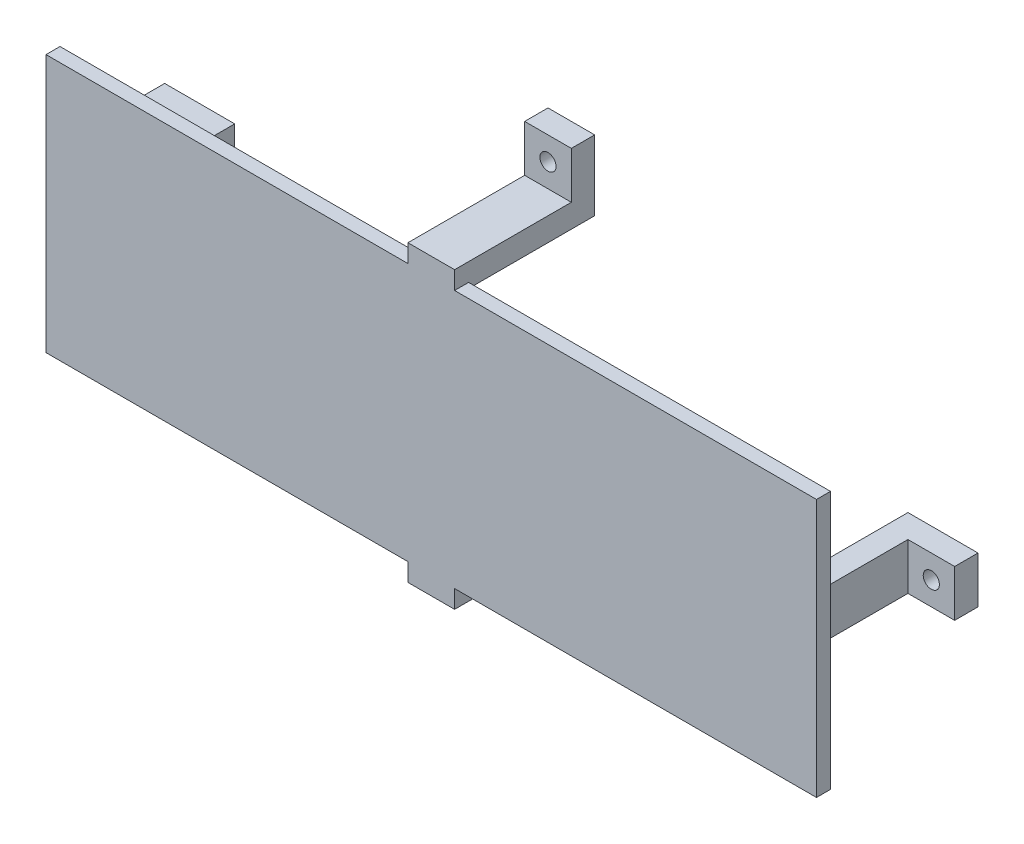
ISO-10303-21;
HEADER;
FILE_DESCRIPTION(('STEP AP214'),'2;1');
FILE_NAME('part.step','',(''),(''),'','','');
FILE_SCHEMA(('AUTOMOTIVE_DESIGN { 1 0 10303 214 1 1 1 1 }'));
ENDSEC;
DATA;
#1=APPLICATION_CONTEXT('core data for automotive mechanical design processes');
#2=APPLICATION_PROTOCOL_DEFINITION('international standard','automotive_design',2000,#1);
#3=PRODUCT_CONTEXT('',#1,'mechanical');
#4=PRODUCT('Part','Part','',(#3));
#5=PRODUCT_RELATED_PRODUCT_CATEGORY('part','',(#4));
#6=PRODUCT_DEFINITION_FORMATION('','',#4);
#7=PRODUCT_DEFINITION_CONTEXT('part definition',#1,'design');
#8=PRODUCT_DEFINITION('design','',#6,#7);
#9=PRODUCT_DEFINITION_SHAPE('','',#8);
#10=(LENGTH_UNIT() NAMED_UNIT(*) SI_UNIT(.MILLI.,.METRE.));
#11=(NAMED_UNIT(*) PLANE_ANGLE_UNIT() SI_UNIT($,.RADIAN.));
#12=(NAMED_UNIT(*) SI_UNIT($,.STERADIAN.) SOLID_ANGLE_UNIT());
#13=UNCERTAINTY_MEASURE_WITH_UNIT(LENGTH_MEASURE(1.E-05),#10,'distance_accuracy_value','');
#14=(GEOMETRIC_REPRESENTATION_CONTEXT(3) GLOBAL_UNCERTAINTY_ASSIGNED_CONTEXT((#13)) GLOBAL_UNIT_ASSIGNED_CONTEXT((#10,
#11,#12)) REPRESENTATION_CONTEXT('',''));
#15=CARTESIAN_POINT('',(0.,0.,0.));
#16=DIRECTION('',(0.,0.,1.));
#17=DIRECTION('',(1.,0.,0.));
#18=AXIS2_PLACEMENT_3D('',#15,#16,#17);
#19=CARTESIAN_POINT('',(-5.,-31.5,27.));
#20=DIRECTION('',(0.,1.,0.));
#21=DIRECTION('',(0.,0.,1.));
#22=AXIS2_PLACEMENT_3D('',#19,#20,#21);
#23=PLANE('',#22);
#24=DIRECTION('',(-1.,0.,0.));
#25=VECTOR('',#24,1.);
#26=CARTESIAN_POINT('',(16.180339887499,-31.5,5.));
#27=LINE('',#26,#25);
#28=CARTESIAN_POINT('',(5.,-31.5,5.));
#29=VERTEX_POINT('',#28);
#30=CARTESIAN_POINT('',(-5.00000000000001,-31.5,5.));
#31=VERTEX_POINT('',#30);
#32=EDGE_CURVE('E55',#29,#31,#27,.T.);
#33=ORIENTED_EDGE('',*,*,#32,.F.);
#34=DIRECTION('',(0.,0.,-1.));
#35=VECTOR('',#34,1.);
#36=CARTESIAN_POINT('',(5.,-31.5,27.));
#37=LINE('',#36,#35);
#38=CARTESIAN_POINT('',(5.,-31.5,30.));
#39=VERTEX_POINT('',#38);
#40=EDGE_CURVE('E431',#39,#29,#37,.T.);
#41=ORIENTED_EDGE('',*,*,#40,.F.);
#42=DIRECTION('',(1.,0.,0.));
#43=VECTOR('',#42,1.);
#44=CARTESIAN_POINT('',(-5.,-31.5,30.));
#45=LINE('',#44,#43);
#46=CARTESIAN_POINT('',(-5.,-31.5,30.));
#47=VERTEX_POINT('',#46);
#48=EDGE_CURVE('E377',#47,#39,#45,.T.);
#49=ORIENTED_EDGE('',*,*,#48,.F.);
#50=DIRECTION('',(0.,0.,-1.));
#51=VECTOR('',#50,1.);
#52=CARTESIAN_POINT('',(-5.,-31.5,27.));
#53=LINE('',#52,#51);
#54=EDGE_CURVE('E434',#47,#31,#53,.T.);
#55=ORIENTED_EDGE('',*,*,#54,.T.);
#56=EDGE_LOOP('',(#33,#41,#49,#55));
#57=FACE_BOUND('',#56,.T.);
#58=ADVANCED_FACE('F39',(#57),#23,.F.);
#59=CARTESIAN_POINT('',(-82.5,-27.64,30.));
#60=DIRECTION('',(0.,1.,0.));
#61=DIRECTION('',(0.,0.,1.));
#62=AXIS2_PLACEMENT_3D('',#59,#60,#61);
#63=PLANE('',#62);
#64=DIRECTION('',(0.,0.,-1.));
#65=VECTOR('',#64,1.);
#66=CARTESIAN_POINT('',(5.,-27.64,40.7191230984629));
#67=LINE('',#66,#65);
#68=CARTESIAN_POINT('',(5.,-27.64,30.));
#69=VERTEX_POINT('',#68);
#70=CARTESIAN_POINT('',(5.,-27.64,27.));
#71=VERTEX_POINT('',#70);
#72=EDGE_CURVE('E354',#69,#71,#67,.T.);
#73=ORIENTED_EDGE('',*,*,#72,.T.);
#74=DIRECTION('',(1.,0.,0.));
#75=VECTOR('',#74,1.);
#76=CARTESIAN_POINT('',(-82.5,-27.64,27.));
#77=LINE('',#76,#75);
#78=CARTESIAN_POINT('',(82.5,-27.64,27.));
#79=VERTEX_POINT('',#78);
#80=EDGE_CURVE('E533',#71,#79,#77,.T.);
#81=ORIENTED_EDGE('',*,*,#80,.T.);
#82=DIRECTION('',(0.,0.,-1.));
#83=VECTOR('',#82,1.);
#84=CARTESIAN_POINT('',(82.5,-27.64,30.));
#85=LINE('',#84,#83);
#86=CARTESIAN_POINT('',(82.5,-27.64,30.));
#87=VERTEX_POINT('',#86);
#88=EDGE_CURVE('E552',#87,#79,#85,.T.);
#89=ORIENTED_EDGE('',*,*,#88,.F.);
#90=DIRECTION('',(1.,0.,0.));
#91=VECTOR('',#90,1.);
#92=CARTESIAN_POINT('',(-82.5,-27.64,30.));
#93=LINE('',#92,#91);
#94=EDGE_CURVE('E515',#69,#87,#93,.T.);
#95=ORIENTED_EDGE('',*,*,#94,.F.);
#96=EDGE_LOOP('',(#73,#81,#89,#95));
#97=FACE_BOUND('',#96,.T.);
#98=ADVANCED_FACE('F635',(#97),#63,.F.);
#99=DIRECTION('',(0.,0.,-1.));
#100=VECTOR('',#99,1.);
#101=CARTESIAN_POINT('',(-5.,-27.64,40.7191230984629));
#102=LINE('',#101,#100);
#103=CARTESIAN_POINT('',(-5.,-27.64,30.));
#104=VERTEX_POINT('',#103);
#105=CARTESIAN_POINT('',(-5.,-27.64,27.));
#106=VERTEX_POINT('',#105);
#107=EDGE_CURVE('E385',#104,#106,#102,.T.);
#108=ORIENTED_EDGE('',*,*,#107,.F.);
#109=CARTESIAN_POINT('',(-82.5,-27.64,30.));
#110=VERTEX_POINT('',#109);
#111=EDGE_CURVE('E517',#110,#104,#93,.T.);
#112=ORIENTED_EDGE('',*,*,#111,.F.);
#113=DIRECTION('',(0.,0.,-1.));
#114=VECTOR('',#113,1.);
#115=CARTESIAN_POINT('',(-82.5,-27.64,30.));
#116=LINE('',#115,#114);
#117=CARTESIAN_POINT('',(-82.5,-27.64,27.));
#118=VERTEX_POINT('',#117);
#119=EDGE_CURVE('E556',#110,#118,#116,.T.);
#120=ORIENTED_EDGE('',*,*,#119,.T.);
#121=EDGE_CURVE('E534',#118,#106,#77,.T.);
#122=ORIENTED_EDGE('',*,*,#121,.T.);
#123=EDGE_LOOP('',(#108,#112,#120,#122));
#124=FACE_BOUND('',#123,.T.);
#125=ADVANCED_FACE('F640',(#124),#63,.F.);
#126=CARTESIAN_POINT('',(-82.5,27.64,30.));
#127=DIRECTION('',(0.,-1.,0.));
#128=DIRECTION('',(0.,0.,-1.));
#129=AXIS2_PLACEMENT_3D('',#126,#127,#128);
#130=PLANE('',#129);
#131=DIRECTION('',(0.,0.,-1.));
#132=VECTOR('',#131,1.);
#133=CARTESIAN_POINT('',(-5.,27.64,40.7191230984629));
#134=LINE('',#133,#132);
#135=CARTESIAN_POINT('',(-5.,27.64,30.));
#136=VERTEX_POINT('',#135);
#137=CARTESIAN_POINT('',(-5.,27.64,27.));
#138=VERTEX_POINT('',#137);
#139=EDGE_CURVE('E376',#136,#138,#134,.T.);
#140=ORIENTED_EDGE('',*,*,#139,.T.);
#141=DIRECTION('',(-1.,0.,0.));
#142=VECTOR('',#141,1.);
#143=CARTESIAN_POINT('',(-82.5,27.64,27.));
#144=LINE('',#143,#142);
#145=CARTESIAN_POINT('',(-82.5,27.64,27.));
#146=VERTEX_POINT('',#145);
#147=EDGE_CURVE('E541',#138,#146,#144,.T.);
#148=ORIENTED_EDGE('',*,*,#147,.T.);
#149=DIRECTION('',(0.,0.,-1.));
#150=VECTOR('',#149,1.);
#151=CARTESIAN_POINT('',(-82.5,27.64,30.));
#152=LINE('',#151,#150);
#153=CARTESIAN_POINT('',(-82.5,27.64,30.));
#154=VERTEX_POINT('',#153);
#155=EDGE_CURVE('E529',#154,#146,#152,.T.);
#156=ORIENTED_EDGE('',*,*,#155,.F.);
#157=DIRECTION('',(-1.,0.,0.));
#158=VECTOR('',#157,1.);
#159=CARTESIAN_POINT('',(-82.5,27.64,30.));
#160=LINE('',#159,#158);
#161=EDGE_CURVE('E524',#136,#154,#160,.T.);
#162=ORIENTED_EDGE('',*,*,#161,.F.);
#163=EDGE_LOOP('',(#140,#148,#156,#162));
#164=FACE_BOUND('',#163,.T.);
#165=ADVANCED_FACE('F698',(#164),#130,.F.);
#166=DIRECTION('',(0.,0.,-1.));
#167=VECTOR('',#166,1.);
#168=CARTESIAN_POINT('',(5.,27.64,40.7191230984629));
#169=LINE('',#168,#167);
#170=CARTESIAN_POINT('',(4.99999999999999,27.64,30.));
#171=VERTEX_POINT('',#170);
#172=CARTESIAN_POINT('',(5.,27.64,27.));
#173=VERTEX_POINT('',#172);
#174=EDGE_CURVE('E403',#171,#173,#169,.T.);
#175=ORIENTED_EDGE('',*,*,#174,.F.);
#176=CARTESIAN_POINT('',(82.5,27.64,30.));
#177=VERTEX_POINT('',#176);
#178=EDGE_CURVE('E525',#177,#171,#160,.T.);
#179=ORIENTED_EDGE('',*,*,#178,.F.);
#180=DIRECTION('',(0.,0.,-1.));
#181=VECTOR('',#180,1.);
#182=CARTESIAN_POINT('',(82.5,27.64,30.));
#183=LINE('',#182,#181);
#184=CARTESIAN_POINT('',(82.5,27.64,27.));
#185=VERTEX_POINT('',#184);
#186=EDGE_CURVE('E548',#177,#185,#183,.T.);
#187=ORIENTED_EDGE('',*,*,#186,.T.);
#188=EDGE_CURVE('E516',#185,#173,#144,.T.);
#189=ORIENTED_EDGE('',*,*,#188,.T.);
#190=EDGE_LOOP('',(#175,#179,#187,#189));
#191=FACE_BOUND('',#190,.T.);
#192=ADVANCED_FACE('F696',(#191),#130,.F.);
#193=CARTESIAN_POINT('',(0.,0.,27.));
#194=DIRECTION('',(0.,0.,1.));
#195=DIRECTION('',(1.,0.,0.));
#196=AXIS2_PLACEMENT_3D('',#193,#194,#195);
#197=PLANE('',#196);
#198=DIRECTION('',(0.,1.,0.));
#199=VECTOR('',#198,1.);
#200=CARTESIAN_POINT('',(77.085,4.99999999999998,27.));
#201=LINE('',#200,#199);
#202=CARTESIAN_POINT('',(77.085,-5.00000000000002,27.));
#203=VERTEX_POINT('',#202);
#204=CARTESIAN_POINT('',(77.085,4.99999999999998,27.));
#205=VERTEX_POINT('',#204);
#206=EDGE_CURVE('E438',#203,#205,#201,.T.);
#207=ORIENTED_EDGE('',*,*,#206,.T.);
#208=DIRECTION('',(-1.,0.,0.));
#209=VECTOR('',#208,1.);
#210=CARTESIAN_POINT('',(77.085,4.99999999999998,27.));
#211=LINE('',#210,#209);
#212=CARTESIAN_POINT('',(72.085,4.99999999999998,27.));
#213=VERTEX_POINT('',#212);
#214=EDGE_CURVE('E441',#205,#213,#211,.T.);
#215=ORIENTED_EDGE('',*,*,#214,.T.);
#216=DIRECTION('',(0.,-1.,0.));
#217=VECTOR('',#216,1.);
#218=CARTESIAN_POINT('',(72.085,4.99999999999998,27.));
#219=LINE('',#218,#217);
#220=CARTESIAN_POINT('',(72.085,-5.00000000000002,27.));
#221=VERTEX_POINT('',#220);
#222=EDGE_CURVE('E445',#213,#221,#219,.T.);
#223=ORIENTED_EDGE('',*,*,#222,.T.);
#224=DIRECTION('',(1.,0.,0.));
#225=VECTOR('',#224,1.);
#226=CARTESIAN_POINT('',(77.085,-5.00000000000002,27.));
#227=LINE('',#226,#225);
#228=EDGE_CURVE('E448',#221,#203,#227,.T.);
#229=ORIENTED_EDGE('',*,*,#228,.T.);
#230=EDGE_LOOP('',(#207,#215,#223,#229));
#231=FACE_BOUND('',#230,.T.);
#232=DIRECTION('',(-1.,0.,0.));
#233=VECTOR('',#232,1.);
#234=CARTESIAN_POINT('',(-77.085,4.99999999999998,27.));
#235=LINE('',#234,#233);
#236=CARTESIAN_POINT('',(-72.085,4.99999999999998,27.));
#237=VERTEX_POINT('',#236);
#238=CARTESIAN_POINT('',(-77.085,4.99999999999998,27.));
#239=VERTEX_POINT('',#238);
#240=EDGE_CURVE('E574',#237,#239,#235,.T.);
#241=ORIENTED_EDGE('',*,*,#240,.T.);
#242=DIRECTION('',(0.,-1.,0.));
#243=VECTOR('',#242,1.);
#244=CARTESIAN_POINT('',(-77.085,4.99999999999998,27.));
#245=LINE('',#244,#243);
#246=CARTESIAN_POINT('',(-77.085,-5.00000000000002,27.));
#247=VERTEX_POINT('',#246);
#248=EDGE_CURVE('E561',#239,#247,#245,.T.);
#249=ORIENTED_EDGE('',*,*,#248,.T.);
#250=DIRECTION('',(1.,0.,0.));
#251=VECTOR('',#250,1.);
#252=CARTESIAN_POINT('',(-77.085,-5.00000000000002,27.));
#253=LINE('',#252,#251);
#254=CARTESIAN_POINT('',(-72.085,-5.00000000000002,27.));
#255=VERTEX_POINT('',#254);
#256=EDGE_CURVE('E565',#247,#255,#253,.T.);
#257=ORIENTED_EDGE('',*,*,#256,.T.);
#258=DIRECTION('',(0.,1.,0.));
#259=VECTOR('',#258,1.);
#260=CARTESIAN_POINT('',(-72.085,4.99999999999998,27.));
#261=LINE('',#260,#259);
#262=EDGE_CURVE('E570',#255,#237,#261,.T.);
#263=ORIENTED_EDGE('',*,*,#262,.T.);
#264=EDGE_LOOP('',(#241,#249,#257,#263));
#265=FACE_BOUND('',#264,.T.);
#266=DIRECTION('',(0.,-1.,0.));
#267=VECTOR('',#266,1.);
#268=CARTESIAN_POINT('',(-5.,-31.5,27.));
#269=LINE('',#268,#267);
#270=CARTESIAN_POINT('',(-5.,-26.5,27.));
#271=VERTEX_POINT('',#270);
#272=EDGE_CURVE('E409',#271,#106,#269,.T.);
#273=ORIENTED_EDGE('',*,*,#272,.T.);
#274=ORIENTED_EDGE('',*,*,#121,.F.);
#275=DIRECTION('',(0.,-1.,0.));
#276=VECTOR('',#275,1.);
#277=CARTESIAN_POINT('',(-82.5,27.64,27.));
#278=LINE('',#277,#276);
#279=EDGE_CURVE('E510',#146,#118,#278,.T.);
#280=ORIENTED_EDGE('',*,*,#279,.F.);
#281=ORIENTED_EDGE('',*,*,#147,.F.);
#282=DIRECTION('',(0.,-1.,0.));
#283=VECTOR('',#282,1.);
#284=CARTESIAN_POINT('',(-5.00000000000001,31.5,27.));
#285=LINE('',#284,#283);
#286=CARTESIAN_POINT('',(-5.00000000000001,26.5,27.));
#287=VERTEX_POINT('',#286);
#288=EDGE_CURVE('E474',#138,#287,#285,.T.);
#289=ORIENTED_EDGE('',*,*,#288,.T.);
#290=DIRECTION('',(1.,0.,0.));
#291=VECTOR('',#290,1.);
#292=CARTESIAN_POINT('',(-5.00000000000001,26.5,27.));
#293=LINE('',#292,#291);
#294=CARTESIAN_POINT('',(5.,26.5,27.));
#295=VERTEX_POINT('',#294);
#296=EDGE_CURVE('E478',#287,#295,#293,.T.);
#297=ORIENTED_EDGE('',*,*,#296,.T.);
#298=DIRECTION('',(0.,1.,0.));
#299=VECTOR('',#298,1.);
#300=CARTESIAN_POINT('',(4.99999999999999,31.5,27.));
#301=LINE('',#300,#299);
#302=EDGE_CURVE('E483',#295,#173,#301,.T.);
#303=ORIENTED_EDGE('',*,*,#302,.T.);
#304=ORIENTED_EDGE('',*,*,#188,.F.);
#305=DIRECTION('',(0.,1.,0.));
#306=VECTOR('',#305,1.);
#307=CARTESIAN_POINT('',(82.5,27.64,27.));
#308=LINE('',#307,#306);
#309=EDGE_CURVE('E538',#79,#185,#308,.T.);
#310=ORIENTED_EDGE('',*,*,#309,.F.);
#311=ORIENTED_EDGE('',*,*,#80,.F.);
#312=DIRECTION('',(0.,1.,0.));
#313=VECTOR('',#312,1.);
#314=CARTESIAN_POINT('',(5.,-31.5,27.));
#315=LINE('',#314,#313);
#316=CARTESIAN_POINT('',(5.,-26.5,27.));
#317=VERTEX_POINT('',#316);
#318=EDGE_CURVE('E412',#71,#317,#315,.T.);
#319=ORIENTED_EDGE('',*,*,#318,.T.);
#320=DIRECTION('',(-1.,0.,0.));
#321=VECTOR('',#320,1.);
#322=CARTESIAN_POINT('',(-5.,-26.5,27.));
#323=LINE('',#322,#321);
#324=EDGE_CURVE('E417',#317,#271,#323,.T.);
#325=ORIENTED_EDGE('',*,*,#324,.T.);
#326=EDGE_LOOP('',(#273,#274,#280,#281,#289,#297,#303,#304,#310,#311,#319,#325));
#327=FACE_BOUND('',#326,.T.);
#328=ADVANCED_FACE('F609',(#231,#265,#327),#197,.F.);
#329=CARTESIAN_POINT('',(-77.085,4.99999999999998,27.));
#330=DIRECTION('',(1.,0.,0.));
#331=DIRECTION('',(0.,0.,-1.));
#332=AXIS2_PLACEMENT_3D('',#329,#330,#331);
#333=PLANE('',#332);
#334=DIRECTION('',(0.,0.,-1.));
#335=VECTOR('',#334,1.);
#336=CARTESIAN_POINT('',(-77.085,4.99999999999998,27.));
#337=LINE('',#336,#335);
#338=CARTESIAN_POINT('',(-77.085,4.99999999999998,5.));
#339=VERTEX_POINT('',#338);
#340=EDGE_CURVE('E578',#239,#339,#337,.T.);
#341=ORIENTED_EDGE('',*,*,#340,.T.);
#342=DIRECTION('',(0.,1.,0.));
#343=VECTOR('',#342,1.);
#344=CARTESIAN_POINT('',(-77.085,-16.180339887499,5.));
#345=LINE('',#344,#343);
#346=CARTESIAN_POINT('',(-77.085,-5.00000000000002,5.));
#347=VERTEX_POINT('',#346);
#348=EDGE_CURVE('E351',#347,#339,#345,.T.);
#349=ORIENTED_EDGE('',*,*,#348,.F.);
#350=DIRECTION('',(0.,0.,-1.));
#351=VECTOR('',#350,1.);
#352=CARTESIAN_POINT('',(-77.085,-5.00000000000002,27.));
#353=LINE('',#352,#351);
#354=EDGE_CURVE('E11',#247,#347,#353,.T.);
#355=ORIENTED_EDGE('',*,*,#354,.F.);
#356=ORIENTED_EDGE('',*,*,#248,.F.);
#357=EDGE_LOOP('',(#341,#349,#355,#356));
#358=FACE_BOUND('',#357,.T.);
#359=ADVANCED_FACE('F41',(#358),#333,.F.);
#360=CARTESIAN_POINT('',(-77.085,-5.00000000000002,27.));
#361=DIRECTION('',(0.,1.,0.));
#362=DIRECTION('',(0.,0.,1.));
#363=AXIS2_PLACEMENT_3D('',#360,#361,#362);
#364=PLANE('',#363);
#365=DIRECTION('',(1.,0.,0.));
#366=VECTOR('',#365,1.);
#367=CARTESIAN_POINT('',(-77.085,-5.00000000000002,0.));
#368=LINE('',#367,#366);
#369=CARTESIAN_POINT('',(-87.085,-5.00000000000002,0.));
#370=VERTEX_POINT('',#369);
#371=CARTESIAN_POINT('',(-72.085,-5.00000000000002,0.));
#372=VERTEX_POINT('',#371);
#373=EDGE_CURVE('E560',#370,#372,#368,.T.);
#374=ORIENTED_EDGE('',*,*,#373,.T.);
#375=DIRECTION('',(0.,0.,-1.));
#376=VECTOR('',#375,1.);
#377=CARTESIAN_POINT('',(-72.085,-5.00000000000002,27.));
#378=LINE('',#377,#376);
#379=EDGE_CURVE('E48',#255,#372,#378,.T.);
#380=ORIENTED_EDGE('',*,*,#379,.F.);
#381=ORIENTED_EDGE('',*,*,#256,.F.);
#382=ORIENTED_EDGE('',*,*,#354,.T.);
#383=DIRECTION('',(-1.,0.,0.));
#384=VECTOR('',#383,1.);
#385=CARTESIAN_POINT('',(-77.085,-5.00000000000002,5.));
#386=LINE('',#385,#384);
#387=CARTESIAN_POINT('',(-87.085,-5.00000000000002,5.));
#388=VERTEX_POINT('',#387);
#389=EDGE_CURVE('E350',#347,#388,#386,.T.);
#390=ORIENTED_EDGE('',*,*,#389,.T.);
#391=DIRECTION('',(0.,0.,-1.));
#392=VECTOR('',#391,1.);
#393=CARTESIAN_POINT('',(-87.085,-5.00000000000002,0.));
#394=LINE('',#393,#392);
#395=EDGE_CURVE('E346',#388,#370,#394,.T.);
#396=ORIENTED_EDGE('',*,*,#395,.T.);
#397=EDGE_LOOP('',(#374,#380,#381,#382,#390,#396));
#398=FACE_BOUND('',#397,.T.);
#399=ADVANCED_FACE('F612',(#398),#364,.F.);
#400=CARTESIAN_POINT('',(-72.085,4.99999999999998,27.));
#401=DIRECTION('',(-1.,0.,0.));
#402=DIRECTION('',(0.,0.,1.));
#403=AXIS2_PLACEMENT_3D('',#400,#401,#402);
#404=PLANE('',#403);
#405=DIRECTION('',(0.,1.,0.));
#406=VECTOR('',#405,1.);
#407=CARTESIAN_POINT('',(-72.085,4.99999999999998,0.));
#408=LINE('',#407,#406);
#409=CARTESIAN_POINT('',(-72.085,4.99999999999998,0.));
#410=VERTEX_POINT('',#409);
#411=EDGE_CURVE('E581',#372,#410,#408,.T.);
#412=ORIENTED_EDGE('',*,*,#411,.T.);
#413=DIRECTION('',(0.,0.,-1.));
#414=VECTOR('',#413,1.);
#415=CARTESIAN_POINT('',(-72.085,4.99999999999998,27.));
#416=LINE('',#415,#414);
#417=EDGE_CURVE('E588',#237,#410,#416,.T.);
#418=ORIENTED_EDGE('',*,*,#417,.F.);
#419=ORIENTED_EDGE('',*,*,#262,.F.);
#420=ORIENTED_EDGE('',*,*,#379,.T.);
#421=EDGE_LOOP('',(#412,#418,#419,#420));
#422=FACE_BOUND('',#421,.T.);
#423=ADVANCED_FACE('F596',(#422),#404,.F.);
#424=CARTESIAN_POINT('',(-77.085,4.99999999999998,27.));
#425=DIRECTION('',(0.,-1.,0.));
#426=DIRECTION('',(0.,0.,-1.));
#427=AXIS2_PLACEMENT_3D('',#424,#425,#426);
#428=PLANE('',#427);
#429=DIRECTION('',(-1.,0.,0.));
#430=VECTOR('',#429,1.);
#431=CARTESIAN_POINT('',(-77.085,4.99999999999998,0.));
#432=LINE('',#431,#430);
#433=CARTESIAN_POINT('',(-87.085,4.99999999999998,0.));
#434=VERTEX_POINT('',#433);
#435=EDGE_CURVE('E566',#410,#434,#432,.T.);
#436=ORIENTED_EDGE('',*,*,#435,.T.);
#437=DIRECTION('',(0.,0.,1.));
#438=VECTOR('',#437,1.);
#439=CARTESIAN_POINT('',(-87.085,4.99999999999998,0.));
#440=LINE('',#439,#438);
#441=CARTESIAN_POINT('',(-87.085,4.99999999999998,5.));
#442=VERTEX_POINT('',#441);
#443=EDGE_CURVE('E329',#434,#442,#440,.T.);
#444=ORIENTED_EDGE('',*,*,#443,.T.);
#445=DIRECTION('',(1.,0.,0.));
#446=VECTOR('',#445,1.);
#447=CARTESIAN_POINT('',(-77.085,4.99999999999998,5.));
#448=LINE('',#447,#446);
#449=EDGE_CURVE('E358',#442,#339,#448,.T.);
#450=ORIENTED_EDGE('',*,*,#449,.T.);
#451=ORIENTED_EDGE('',*,*,#340,.F.);
#452=ORIENTED_EDGE('',*,*,#240,.F.);
#453=ORIENTED_EDGE('',*,*,#417,.T.);
#454=EDGE_LOOP('',(#436,#444,#450,#451,#452,#453));
#455=FACE_BOUND('',#454,.T.);
#456=ADVANCED_FACE('F604',(#455),#428,.F.);
#457=CARTESIAN_POINT('',(0.,0.,0.));
#458=DIRECTION('',(0.,0.,1.));
#459=DIRECTION('',(1.,0.,0.));
#460=AXIS2_PLACEMENT_3D('',#457,#458,#459);
#461=PLANE('',#460);
#462=CARTESIAN_POINT('',(-82.085,0.,0.));
#463=DIRECTION('',(0.,0.,1.));
#464=DIRECTION('',(1.,0.,0.));
#465=AXIS2_PLACEMENT_3D('',#462,#463,#464);
#466=CIRCLE('',#465,1.72999999999999);
#467=CARTESIAN_POINT('',(-80.355,0.,0.));
#468=VERTEX_POINT('',#467);
#469=EDGE_CURVE('E279',#468,#468,#466,.T.);
#470=ORIENTED_EDGE('',*,*,#469,.T.);
#471=EDGE_LOOP('',(#470));
#472=FACE_BOUND('',#471,.T.);
#473=ORIENTED_EDGE('',*,*,#373,.F.);
#474=DIRECTION('',(0.,1.,0.));
#475=VECTOR('',#474,1.);
#476=CARTESIAN_POINT('',(-87.085,-16.180339887499,0.));
#477=LINE('',#476,#475);
#478=EDGE_CURVE('E362',#370,#434,#477,.T.);
#479=ORIENTED_EDGE('',*,*,#478,.T.);
#480=ORIENTED_EDGE('',*,*,#435,.F.);
#481=ORIENTED_EDGE('',*,*,#411,.F.);
#482=EDGE_LOOP('',(#473,#479,#480,#481));
#483=FACE_BOUND('',#482,.T.);
#484=ADVANCED_FACE('F600',(#472,#483),#461,.F.);
#485=CARTESIAN_POINT('',(-82.5,27.64,30.));
#486=DIRECTION('',(1.,0.,0.));
#487=DIRECTION('',(0.,0.,-1.));
#488=AXIS2_PLACEMENT_3D('',#485,#486,#487);
#489=PLANE('',#488);
#490=ORIENTED_EDGE('',*,*,#279,.T.);
#491=ORIENTED_EDGE('',*,*,#119,.F.);
#492=DIRECTION('',(0.,-1.,0.));
#493=VECTOR('',#492,1.);
#494=CARTESIAN_POINT('',(-82.5,27.64,30.));
#495=LINE('',#494,#493);
#496=EDGE_CURVE('E511',#154,#110,#495,.T.);
#497=ORIENTED_EDGE('',*,*,#496,.F.);
#498=ORIENTED_EDGE('',*,*,#155,.T.);
#499=EDGE_LOOP('',(#490,#491,#497,#498));
#500=FACE_BOUND('',#499,.T.);
#501=ADVANCED_FACE('F703',(#500),#489,.F.);
#502=CARTESIAN_POINT('',(82.5,27.64,30.));
#503=DIRECTION('',(-1.,0.,0.));
#504=DIRECTION('',(0.,-1.,0.));
#505=AXIS2_PLACEMENT_3D('',#502,#503,#504);
#506=PLANE('',#505);
#507=ORIENTED_EDGE('',*,*,#309,.T.);
#508=ORIENTED_EDGE('',*,*,#186,.F.);
#509=DIRECTION('',(0.,1.,0.));
#510=VECTOR('',#509,1.);
#511=CARTESIAN_POINT('',(82.5,27.64,30.));
#512=LINE('',#511,#510);
#513=EDGE_CURVE('E521',#87,#177,#512,.T.);
#514=ORIENTED_EDGE('',*,*,#513,.F.);
#515=ORIENTED_EDGE('',*,*,#88,.T.);
#516=EDGE_LOOP('',(#507,#508,#514,#515));
#517=FACE_BOUND('',#516,.T.);
#518=ADVANCED_FACE('F692',(#517),#506,.F.);
#519=CARTESIAN_POINT('',(0.,0.,30.));
#520=DIRECTION('',(0.,0.,1.));
#521=DIRECTION('',(1.,0.,0.));
#522=AXIS2_PLACEMENT_3D('',#519,#520,#521);
#523=PLANE('',#522);
#524=ORIENTED_EDGE('',*,*,#496,.T.);
#525=ORIENTED_EDGE('',*,*,#111,.T.);
#526=DIRECTION('',(0.,-1.,0.));
#527=VECTOR('',#526,1.);
#528=CARTESIAN_POINT('',(-5.,-27.64,30.));
#529=LINE('',#528,#527);
#530=EDGE_CURVE('E381',#104,#47,#529,.T.);
#531=ORIENTED_EDGE('',*,*,#530,.T.);
#532=ORIENTED_EDGE('',*,*,#48,.T.);
#533=DIRECTION('',(0.,1.,0.));
#534=VECTOR('',#533,1.);
#535=CARTESIAN_POINT('',(5.,-31.5,30.));
#536=LINE('',#535,#534);
#537=EDGE_CURVE('E372',#39,#69,#536,.T.);
#538=ORIENTED_EDGE('',*,*,#537,.T.);
#539=ORIENTED_EDGE('',*,*,#94,.T.);
#540=ORIENTED_EDGE('',*,*,#513,.T.);
#541=ORIENTED_EDGE('',*,*,#178,.T.);
#542=DIRECTION('',(0.,1.,0.));
#543=VECTOR('',#542,1.);
#544=CARTESIAN_POINT('',(5.,27.64,30.));
#545=LINE('',#544,#543);
#546=CARTESIAN_POINT('',(4.99999999999999,31.5,30.));
#547=VERTEX_POINT('',#546);
#548=EDGE_CURVE('E263',#171,#547,#545,.T.);
#549=ORIENTED_EDGE('',*,*,#548,.T.);
#550=DIRECTION('',(-1.,0.,0.));
#551=VECTOR('',#550,1.);
#552=CARTESIAN_POINT('',(4.99999999999999,31.5,30.));
#553=LINE('',#552,#551);
#554=CARTESIAN_POINT('',(-5.00000000000001,31.5,30.));
#555=VERTEX_POINT('',#554);
#556=EDGE_CURVE('E399',#547,#555,#553,.T.);
#557=ORIENTED_EDGE('',*,*,#556,.T.);
#558=DIRECTION('',(0.,-1.,0.));
#559=VECTOR('',#558,1.);
#560=CARTESIAN_POINT('',(-5.00000000000001,31.5,30.));
#561=LINE('',#560,#559);
#562=EDGE_CURVE('E395',#555,#136,#561,.T.);
#563=ORIENTED_EDGE('',*,*,#562,.T.);
#564=ORIENTED_EDGE('',*,*,#161,.T.);
#565=EDGE_LOOP('',(#524,#525,#531,#532,#538,#539,#540,#541,#549,#557,#563,#564));
#566=FACE_BOUND('',#565,.T.);
#567=ADVANCED_FACE('F688',(#566),#523,.T.);
#568=CARTESIAN_POINT('',(-5.00000000000001,31.5,27.));
#569=DIRECTION('',(1.,0.,0.));
#570=DIRECTION('',(0.,0.,-1.));
#571=AXIS2_PLACEMENT_3D('',#568,#569,#570);
#572=PLANE('',#571);
#573=DIRECTION('',(0.,-1.,0.));
#574=VECTOR('',#573,1.);
#575=CARTESIAN_POINT('',(-5.00000000000001,31.5,0.));
#576=LINE('',#575,#574);
#577=CARTESIAN_POINT('',(-5.00000000000001,41.5,0.));
#578=VERTEX_POINT('',#577);
#579=CARTESIAN_POINT('',(-5.00000000000001,26.5,0.));
#580=VERTEX_POINT('',#579);
#581=EDGE_CURVE('E473',#578,#580,#576,.T.);
#582=ORIENTED_EDGE('',*,*,#581,.T.);
#583=DIRECTION('',(0.,0.,-1.));
#584=VECTOR('',#583,1.);
#585=CARTESIAN_POINT('',(-5.00000000000001,26.5,27.));
#586=LINE('',#585,#584);
#587=EDGE_CURVE('E506',#287,#580,#586,.T.);
#588=ORIENTED_EDGE('',*,*,#587,.F.);
#589=ORIENTED_EDGE('',*,*,#288,.F.);
#590=ORIENTED_EDGE('',*,*,#139,.F.);
#591=ORIENTED_EDGE('',*,*,#562,.F.);
#592=DIRECTION('',(0.,0.,-1.));
#593=VECTOR('',#592,1.);
#594=CARTESIAN_POINT('',(-5.00000000000001,31.5,27.));
#595=LINE('',#594,#593);
#596=CARTESIAN_POINT('',(-5.00000000000001,31.5,5.));
#597=VERTEX_POINT('',#596);
#598=EDGE_CURVE('E486',#555,#597,#595,.T.);
#599=ORIENTED_EDGE('',*,*,#598,.T.);
#600=DIRECTION('',(0.,1.,0.));
#601=VECTOR('',#600,1.);
#602=CARTESIAN_POINT('',(-5.00000000000001,31.5,5.));
#603=LINE('',#602,#601);
#604=CARTESIAN_POINT('',(-5.00000000000001,41.5,5.));
#605=VERTEX_POINT('',#604);
#606=EDGE_CURVE('E63',#597,#605,#603,.T.);
#607=ORIENTED_EDGE('',*,*,#606,.T.);
#608=DIRECTION('',(0.,0.,-1.));
#609=VECTOR('',#608,1.);
#610=CARTESIAN_POINT('',(-5.00000000000001,41.5,0.));
#611=LINE('',#610,#609);
#612=EDGE_CURVE('E308',#605,#578,#611,.T.);
#613=ORIENTED_EDGE('',*,*,#612,.T.);
#614=EDGE_LOOP('',(#582,#588,#589,#590,#591,#599,#607,#613));
#615=FACE_BOUND('',#614,.T.);
#616=ADVANCED_FACE('F684',(#615),#572,.F.);
#617=CARTESIAN_POINT('',(-5.00000000000001,26.5,27.));
#618=DIRECTION('',(0.,1.,0.));
#619=DIRECTION('',(0.,0.,1.));
#620=AXIS2_PLACEMENT_3D('',#617,#618,#619);
#621=PLANE('',#620);
#622=DIRECTION('',(1.,0.,0.));
#623=VECTOR('',#622,1.);
#624=CARTESIAN_POINT('',(-5.00000000000001,26.5,0.));
#625=LINE('',#624,#623);
#626=CARTESIAN_POINT('',(5.,26.5,0.));
#627=VERTEX_POINT('',#626);
#628=EDGE_CURVE('E490',#580,#627,#625,.T.);
#629=ORIENTED_EDGE('',*,*,#628,.T.);
#630=DIRECTION('',(0.,0.,-1.));
#631=VECTOR('',#630,1.);
#632=CARTESIAN_POINT('',(5.,26.5,27.));
#633=LINE('',#632,#631);
#634=EDGE_CURVE('E502',#295,#627,#633,.T.);
#635=ORIENTED_EDGE('',*,*,#634,.F.);
#636=ORIENTED_EDGE('',*,*,#296,.F.);
#637=ORIENTED_EDGE('',*,*,#587,.T.);
#638=EDGE_LOOP('',(#629,#635,#636,#637));
#639=FACE_BOUND('',#638,.T.);
#640=ADVANCED_FACE('F680',(#639),#621,.F.);
#641=CARTESIAN_POINT('',(4.99999999999999,31.5,27.));
#642=DIRECTION('',(-1.,0.,0.));
#643=DIRECTION('',(0.,-1.,0.));
#644=AXIS2_PLACEMENT_3D('',#641,#642,#643);
#645=PLANE('',#644);
#646=DIRECTION('',(0.,1.,0.));
#647=VECTOR('',#646,1.);
#648=CARTESIAN_POINT('',(4.99999999999999,31.5,0.));
#649=LINE('',#648,#647);
#650=CARTESIAN_POINT('',(5.,41.5,0.));
#651=VERTEX_POINT('',#650);
#652=EDGE_CURVE('E479',#627,#651,#649,.T.);
#653=ORIENTED_EDGE('',*,*,#652,.T.);
#654=DIRECTION('',(0.,0.,1.));
#655=VECTOR('',#654,1.);
#656=CARTESIAN_POINT('',(5.,41.5,0.));
#657=LINE('',#656,#655);
#658=CARTESIAN_POINT('',(5.,41.5,5.));
#659=VERTEX_POINT('',#658);
#660=EDGE_CURVE('E301',#651,#659,#657,.T.);
#661=ORIENTED_EDGE('',*,*,#660,.T.);
#662=DIRECTION('',(0.,-1.,0.));
#663=VECTOR('',#662,1.);
#664=CARTESIAN_POINT('',(5.,31.5,5.));
#665=LINE('',#664,#663);
#666=CARTESIAN_POINT('',(5.,31.5,5.));
#667=VERTEX_POINT('',#666);
#668=EDGE_CURVE('E298',#659,#667,#665,.T.);
#669=ORIENTED_EDGE('',*,*,#668,.T.);
#670=DIRECTION('',(0.,0.,-1.));
#671=VECTOR('',#670,1.);
#672=CARTESIAN_POINT('',(4.99999999999999,31.5,27.));
#673=LINE('',#672,#671);
#674=EDGE_CURVE('E498',#547,#667,#673,.T.);
#675=ORIENTED_EDGE('',*,*,#674,.F.);
#676=ORIENTED_EDGE('',*,*,#548,.F.);
#677=ORIENTED_EDGE('',*,*,#174,.T.);
#678=ORIENTED_EDGE('',*,*,#302,.F.);
#679=ORIENTED_EDGE('',*,*,#634,.T.);
#680=EDGE_LOOP('',(#653,#661,#669,#675,#676,#677,#678,#679));
#681=FACE_BOUND('',#680,.T.);
#682=ADVANCED_FACE('F676',(#681),#645,.F.);
#683=CARTESIAN_POINT('',(-5.00000000000001,31.5,27.));
#684=DIRECTION('',(0.,-1.,0.));
#685=DIRECTION('',(0.,0.,-1.));
#686=AXIS2_PLACEMENT_3D('',#683,#684,#685);
#687=PLANE('',#686);
#688=ORIENTED_EDGE('',*,*,#674,.T.);
#689=DIRECTION('',(-1.,0.,0.));
#690=VECTOR('',#689,1.);
#691=CARTESIAN_POINT('',(16.180339887499,31.5,5.));
#692=LINE('',#691,#690);
#693=EDGE_CURVE('E312',#667,#597,#692,.T.);
#694=ORIENTED_EDGE('',*,*,#693,.T.);
#695=ORIENTED_EDGE('',*,*,#598,.F.);
#696=ORIENTED_EDGE('',*,*,#556,.F.);
#697=EDGE_LOOP('',(#688,#694,#695,#696));
#698=FACE_BOUND('',#697,.T.);
#699=ADVANCED_FACE('F672',(#698),#687,.F.);
#700=CARTESIAN_POINT('',(0.,0.,0.));
#701=DIRECTION('',(0.,0.,1.));
#702=DIRECTION('',(1.,0.,0.));
#703=AXIS2_PLACEMENT_3D('',#700,#701,#702);
#704=PLANE('',#703);
#705=CARTESIAN_POINT('',(0.,36.5,0.));
#706=DIRECTION('',(0.,0.,1.));
#707=DIRECTION('',(-1.,0.,0.));
#708=AXIS2_PLACEMENT_3D('',#705,#706,#707);
#709=CIRCLE('',#708,1.73);
#710=CARTESIAN_POINT('',(-1.73,36.5,0.));
#711=VERTEX_POINT('',#710);
#712=EDGE_CURVE('E1112',#711,#711,#709,.T.);
#713=ORIENTED_EDGE('',*,*,#712,.T.);
#714=EDGE_LOOP('',(#713));
#715=FACE_BOUND('',#714,.T.);
#716=ORIENTED_EDGE('',*,*,#581,.F.);
#717=DIRECTION('',(-1.,0.,0.));
#718=VECTOR('',#717,1.);
#719=CARTESIAN_POINT('',(16.180339887499,41.5,0.));
#720=LINE('',#719,#718);
#721=EDGE_CURVE('E302',#651,#578,#720,.T.);
#722=ORIENTED_EDGE('',*,*,#721,.F.);
#723=ORIENTED_EDGE('',*,*,#652,.F.);
#724=ORIENTED_EDGE('',*,*,#628,.F.);
#725=EDGE_LOOP('',(#716,#722,#723,#724));
#726=FACE_BOUND('',#725,.T.);
#727=ADVANCED_FACE('F668',(#715,#726),#704,.F.);
#728=CARTESIAN_POINT('',(77.085,4.99999999999998,27.));
#729=DIRECTION('',(-1.,0.,0.));
#730=DIRECTION('',(0.,0.,1.));
#731=AXIS2_PLACEMENT_3D('',#728,#729,#730);
#732=PLANE('',#731);
#733=DIRECTION('',(0.,0.,-1.));
#734=VECTOR('',#733,1.);
#735=CARTESIAN_POINT('',(77.085,-5.00000000000002,27.));
#736=LINE('',#735,#734);
#737=CARTESIAN_POINT('',(77.085,-5.00000000000002,5.));
#738=VERTEX_POINT('',#737);
#739=EDGE_CURVE('E451',#203,#738,#736,.T.);
#740=ORIENTED_EDGE('',*,*,#739,.T.);
#741=DIRECTION('',(0.,1.,0.));
#742=VECTOR('',#741,1.);
#743=CARTESIAN_POINT('',(77.085,-16.180339887499,5.));
#744=LINE('',#743,#742);
#745=CARTESIAN_POINT('',(77.085,4.99999999999998,5.));
#746=VERTEX_POINT('',#745);
#747=EDGE_CURVE('E337',#738,#746,#744,.T.);
#748=ORIENTED_EDGE('',*,*,#747,.T.);
#749=DIRECTION('',(0.,0.,-1.));
#750=VECTOR('',#749,1.);
#751=CARTESIAN_POINT('',(77.085,4.99999999999998,27.));
#752=LINE('',#751,#750);
#753=EDGE_CURVE('E469',#205,#746,#752,.T.);
#754=ORIENTED_EDGE('',*,*,#753,.F.);
#755=ORIENTED_EDGE('',*,*,#206,.F.);
#756=EDGE_LOOP('',(#740,#748,#754,#755));
#757=FACE_BOUND('',#756,.T.);
#758=ADVANCED_FACE('F664',(#757),#732,.F.);
#759=CARTESIAN_POINT('',(77.085,4.99999999999998,27.));
#760=DIRECTION('',(0.,-1.,0.));
#761=DIRECTION('',(0.,0.,-1.));
#762=AXIS2_PLACEMENT_3D('',#759,#760,#761);
#763=PLANE('',#762);
#764=DIRECTION('',(-1.,0.,0.));
#765=VECTOR('',#764,1.);
#766=CARTESIAN_POINT('',(77.085,4.99999999999998,0.));
#767=LINE('',#766,#765);
#768=CARTESIAN_POINT('',(87.085,4.99999999999998,0.));
#769=VERTEX_POINT('',#768);
#770=CARTESIAN_POINT('',(72.085,4.99999999999998,0.));
#771=VERTEX_POINT('',#770);
#772=EDGE_CURVE('E437',#769,#771,#767,.T.);
#773=ORIENTED_EDGE('',*,*,#772,.T.);
#774=DIRECTION('',(0.,0.,-1.));
#775=VECTOR('',#774,1.);
#776=CARTESIAN_POINT('',(72.085,4.99999999999998,27.));
#777=LINE('',#776,#775);
#778=EDGE_CURVE('E465',#213,#771,#777,.T.);
#779=ORIENTED_EDGE('',*,*,#778,.F.);
#780=ORIENTED_EDGE('',*,*,#214,.F.);
#781=ORIENTED_EDGE('',*,*,#753,.T.);
#782=DIRECTION('',(1.,0.,0.));
#783=VECTOR('',#782,1.);
#784=CARTESIAN_POINT('',(77.085,4.99999999999998,5.));
#785=LINE('',#784,#783);
#786=CARTESIAN_POINT('',(87.085,4.99999999999998,5.));
#787=VERTEX_POINT('',#786);
#788=EDGE_CURVE('E305',#746,#787,#785,.T.);
#789=ORIENTED_EDGE('',*,*,#788,.T.);
#790=DIRECTION('',(0.,0.,-1.));
#791=VECTOR('',#790,1.);
#792=CARTESIAN_POINT('',(87.085,4.99999999999998,0.));
#793=LINE('',#792,#791);
#794=EDGE_CURVE('E333',#787,#769,#793,.T.);
#795=ORIENTED_EDGE('',*,*,#794,.T.);
#796=EDGE_LOOP('',(#773,#779,#780,#781,#789,#795));
#797=FACE_BOUND('',#796,.T.);
#798=ADVANCED_FACE('F660',(#797),#763,.F.);
#799=CARTESIAN_POINT('',(72.085,4.99999999999998,27.));
#800=DIRECTION('',(1.,0.,0.));
#801=DIRECTION('',(0.,0.,-1.));
#802=AXIS2_PLACEMENT_3D('',#799,#800,#801);
#803=PLANE('',#802);
#804=DIRECTION('',(0.,-1.,0.));
#805=VECTOR('',#804,1.);
#806=CARTESIAN_POINT('',(72.085,4.99999999999998,0.));
#807=LINE('',#806,#805);
#808=CARTESIAN_POINT('',(72.085,-5.00000000000002,0.));
#809=VERTEX_POINT('',#808);
#810=EDGE_CURVE('E454',#771,#809,#807,.T.);
#811=ORIENTED_EDGE('',*,*,#810,.T.);
#812=DIRECTION('',(0.,0.,-1.));
#813=VECTOR('',#812,1.);
#814=CARTESIAN_POINT('',(72.085,-5.00000000000002,27.));
#815=LINE('',#814,#813);
#816=EDGE_CURVE('E461',#221,#809,#815,.T.);
#817=ORIENTED_EDGE('',*,*,#816,.F.);
#818=ORIENTED_EDGE('',*,*,#222,.F.);
#819=ORIENTED_EDGE('',*,*,#778,.T.);
#820=EDGE_LOOP('',(#811,#817,#818,#819));
#821=FACE_BOUND('',#820,.T.);
#822=ADVANCED_FACE('F656',(#821),#803,.F.);
#823=CARTESIAN_POINT('',(77.085,-5.00000000000002,27.));
#824=DIRECTION('',(0.,1.,0.));
#825=DIRECTION('',(0.,0.,1.));
#826=AXIS2_PLACEMENT_3D('',#823,#824,#825);
#827=PLANE('',#826);
#828=DIRECTION('',(1.,0.,0.));
#829=VECTOR('',#828,1.);
#830=CARTESIAN_POINT('',(77.085,-5.00000000000002,0.));
#831=LINE('',#830,#829);
#832=CARTESIAN_POINT('',(87.085,-5.00000000000002,0.));
#833=VERTEX_POINT('',#832);
#834=EDGE_CURVE('E442',#809,#833,#831,.T.);
#835=ORIENTED_EDGE('',*,*,#834,.T.);
#836=DIRECTION('',(0.,0.,1.));
#837=VECTOR('',#836,1.);
#838=CARTESIAN_POINT('',(87.085,-5.00000000000002,0.));
#839=LINE('',#838,#837);
#840=CARTESIAN_POINT('',(87.085,-5.00000000000002,5.));
#841=VERTEX_POINT('',#840);
#842=EDGE_CURVE('E325',#833,#841,#839,.T.);
#843=ORIENTED_EDGE('',*,*,#842,.T.);
#844=DIRECTION('',(-1.,0.,0.));
#845=VECTOR('',#844,1.);
#846=CARTESIAN_POINT('',(77.085,-5.00000000000002,5.));
#847=LINE('',#846,#845);
#848=EDGE_CURVE('E321',#841,#738,#847,.T.);
#849=ORIENTED_EDGE('',*,*,#848,.T.);
#850=ORIENTED_EDGE('',*,*,#739,.F.);
#851=ORIENTED_EDGE('',*,*,#228,.F.);
#852=ORIENTED_EDGE('',*,*,#816,.T.);
#853=EDGE_LOOP('',(#835,#843,#849,#850,#851,#852));
#854=FACE_BOUND('',#853,.T.);
#855=ADVANCED_FACE('F652',(#854),#827,.F.);
#856=CARTESIAN_POINT('',(0.,0.,0.));
#857=DIRECTION('',(0.,0.,-1.));
#858=DIRECTION('',(-1.,0.,0.));
#859=AXIS2_PLACEMENT_3D('',#856,#857,#858);
#860=PLANE('',#859);
#861=CARTESIAN_POINT('',(82.085,0.,0.));
#862=DIRECTION('',(0.,0.,1.));
#863=DIRECTION('',(-1.,0.,0.));
#864=AXIS2_PLACEMENT_3D('',#861,#862,#863);
#865=CIRCLE('',#864,1.72999999999999);
#866=CARTESIAN_POINT('',(80.355,0.,0.));
#867=VERTEX_POINT('',#866);
#868=EDGE_CURVE('E1104',#867,#867,#865,.T.);
#869=ORIENTED_EDGE('',*,*,#868,.T.);
#870=EDGE_LOOP('',(#869));
#871=FACE_BOUND('',#870,.T.);
#872=ORIENTED_EDGE('',*,*,#772,.F.);
#873=DIRECTION('',(0.,1.,0.));
#874=VECTOR('',#873,1.);
#875=CARTESIAN_POINT('',(87.085,-16.180339887499,0.));
#876=LINE('',#875,#874);
#877=EDGE_CURVE('E326',#833,#769,#876,.T.);
#878=ORIENTED_EDGE('',*,*,#877,.F.);
#879=ORIENTED_EDGE('',*,*,#834,.F.);
#880=ORIENTED_EDGE('',*,*,#810,.F.);
#881=EDGE_LOOP('',(#872,#878,#879,#880));
#882=FACE_BOUND('',#881,.T.);
#883=ADVANCED_FACE('F649',(#871,#882),#860,.T.);
#884=CARTESIAN_POINT('',(-5.,-31.5,27.));
#885=DIRECTION('',(1.,0.,0.));
#886=DIRECTION('',(0.,1.,0.));
#887=AXIS2_PLACEMENT_3D('',#884,#885,#886);
#888=PLANE('',#887);
#889=DIRECTION('',(0.,-1.,0.));
#890=VECTOR('',#889,1.);
#891=CARTESIAN_POINT('',(-5.,-31.5,0.));
#892=LINE('',#891,#890);
#893=CARTESIAN_POINT('',(-5.,-26.5,0.));
#894=VERTEX_POINT('',#893);
#895=CARTESIAN_POINT('',(-5.00000000000001,-41.5,0.));
#896=VERTEX_POINT('',#895);
#897=EDGE_CURVE('E251',#894,#896,#892,.T.);
#898=ORIENTED_EDGE('',*,*,#897,.T.);
#899=DIRECTION('',(0.,0.,1.));
#900=VECTOR('',#899,1.);
#901=CARTESIAN_POINT('',(-5.00000000000001,-41.5,0.));
#902=LINE('',#901,#900);
#903=CARTESIAN_POINT('',(-5.00000000000001,-41.5,5.));
#904=VERTEX_POINT('',#903);
#905=EDGE_CURVE('E256',#896,#904,#902,.T.);
#906=ORIENTED_EDGE('',*,*,#905,.T.);
#907=DIRECTION('',(0.,1.,0.));
#908=VECTOR('',#907,1.);
#909=CARTESIAN_POINT('',(-5.00000000000001,-31.5,5.));
#910=LINE('',#909,#908);
#911=EDGE_CURVE('E273',#904,#31,#910,.T.);
#912=ORIENTED_EDGE('',*,*,#911,.T.);
#913=ORIENTED_EDGE('',*,*,#54,.F.);
#914=ORIENTED_EDGE('',*,*,#530,.F.);
#915=ORIENTED_EDGE('',*,*,#107,.T.);
#916=ORIENTED_EDGE('',*,*,#272,.F.);
#917=DIRECTION('',(0.,0.,-1.));
#918=VECTOR('',#917,1.);
#919=CARTESIAN_POINT('',(-5.,-26.5,27.));
#920=LINE('',#919,#918);
#921=EDGE_CURVE('E258',#271,#894,#920,.T.);
#922=ORIENTED_EDGE('',*,*,#921,.T.);
#923=EDGE_LOOP('',(#898,#906,#912,#913,#914,#915,#916,#922));
#924=FACE_BOUND('',#923,.T.);
#925=ADVANCED_FACE('F253',(#924),#888,.F.);
#926=CARTESIAN_POINT('',(5.,-31.5,27.));
#927=DIRECTION('',(-1.,0.,0.));
#928=DIRECTION('',(0.,0.,1.));
#929=AXIS2_PLACEMENT_3D('',#926,#927,#928);
#930=PLANE('',#929);
#931=DIRECTION('',(0.,1.,0.));
#932=VECTOR('',#931,1.);
#933=CARTESIAN_POINT('',(5.,-31.5,0.));
#934=LINE('',#933,#932);
#935=CARTESIAN_POINT('',(5.,-41.5,0.));
#936=VERTEX_POINT('',#935);
#937=CARTESIAN_POINT('',(5.,-26.5,0.));
#938=VERTEX_POINT('',#937);
#939=EDGE_CURVE('E262',#936,#938,#934,.T.);
#940=ORIENTED_EDGE('',*,*,#939,.T.);
#941=DIRECTION('',(0.,0.,-1.));
#942=VECTOR('',#941,1.);
#943=CARTESIAN_POINT('',(5.,-26.5,27.));
#944=LINE('',#943,#942);
#945=EDGE_CURVE('E427',#317,#938,#944,.T.);
#946=ORIENTED_EDGE('',*,*,#945,.F.);
#947=ORIENTED_EDGE('',*,*,#318,.F.);
#948=ORIENTED_EDGE('',*,*,#72,.F.);
#949=ORIENTED_EDGE('',*,*,#537,.F.);
#950=ORIENTED_EDGE('',*,*,#40,.T.);
#951=DIRECTION('',(0.,-1.,0.));
#952=VECTOR('',#951,1.);
#953=CARTESIAN_POINT('',(5.,-31.5,5.));
#954=LINE('',#953,#952);
#955=CARTESIAN_POINT('',(5.,-41.5,5.));
#956=VERTEX_POINT('',#955);
#957=EDGE_CURVE('E288',#29,#956,#954,.T.);
#958=ORIENTED_EDGE('',*,*,#957,.T.);
#959=DIRECTION('',(0.,0.,-1.));
#960=VECTOR('',#959,1.);
#961=CARTESIAN_POINT('',(5.,-41.5,0.));
#962=LINE('',#961,#960);
#963=EDGE_CURVE('E295',#956,#936,#962,.T.);
#964=ORIENTED_EDGE('',*,*,#963,.T.);
#965=EDGE_LOOP('',(#940,#946,#947,#948,#949,#950,#958,#964));
#966=FACE_BOUND('',#965,.T.);
#967=ADVANCED_FACE('F645',(#966),#930,.F.);
#968=CARTESIAN_POINT('',(-5.,-26.5,27.));
#969=DIRECTION('',(0.,-1.,0.));
#970=DIRECTION('',(0.,0.,-1.));
#971=AXIS2_PLACEMENT_3D('',#968,#969,#970);
#972=PLANE('',#971);
#973=DIRECTION('',(-1.,0.,0.));
#974=VECTOR('',#973,1.);
#975=CARTESIAN_POINT('',(-5.,-26.5,0.));
#976=LINE('',#975,#974);
#977=EDGE_CURVE('E413',#938,#894,#976,.T.);
#978=ORIENTED_EDGE('',*,*,#977,.T.);
#979=ORIENTED_EDGE('',*,*,#921,.F.);
#980=ORIENTED_EDGE('',*,*,#324,.F.);
#981=ORIENTED_EDGE('',*,*,#945,.T.);
#982=EDGE_LOOP('',(#978,#979,#980,#981));
#983=FACE_BOUND('',#982,.T.);
#984=ADVANCED_FACE('F752',(#983),#972,.F.);
#985=CARTESIAN_POINT('',(0.,0.,0.));
#986=DIRECTION('',(0.,0.,-1.));
#987=DIRECTION('',(-1.,0.,0.));
#988=AXIS2_PLACEMENT_3D('',#985,#986,#987);
#989=PLANE('',#988);
#990=CARTESIAN_POINT('',(0.,-36.5,0.));
#991=DIRECTION('',(0.,0.,1.));
#992=DIRECTION('',(1.,0.,0.));
#993=AXIS2_PLACEMENT_3D('',#990,#991,#992);
#994=CIRCLE('',#993,1.73);
#995=CARTESIAN_POINT('',(1.73,-36.5,0.));
#996=VERTEX_POINT('',#995);
#997=EDGE_CURVE('E1094',#996,#996,#994,.T.);
#998=ORIENTED_EDGE('',*,*,#997,.T.);
#999=EDGE_LOOP('',(#998));
#1000=FACE_BOUND('',#999,.T.);
#1001=ORIENTED_EDGE('',*,*,#897,.F.);
#1002=ORIENTED_EDGE('',*,*,#977,.F.);
#1003=ORIENTED_EDGE('',*,*,#939,.F.);
#1004=DIRECTION('',(-1.,0.,0.));
#1005=VECTOR('',#1004,1.);
#1006=CARTESIAN_POINT('',(16.180339887499,-41.5,0.));
#1007=LINE('',#1006,#1005);
#1008=EDGE_CURVE('E266',#936,#896,#1007,.T.);
#1009=ORIENTED_EDGE('',*,*,#1008,.T.);
#1010=EDGE_LOOP('',(#1001,#1002,#1003,#1009));
#1011=FACE_BOUND('',#1010,.T.);
#1012=ADVANCED_FACE('F267',(#1000,#1011),#989,.T.);
#1013=CARTESIAN_POINT('',(-77.085,-16.180339887499,5.));
#1014=DIRECTION('',(0.,0.,1.));
#1015=DIRECTION('',(1.,0.,0.));
#1016=AXIS2_PLACEMENT_3D('',#1013,#1014,#1015);
#1017=PLANE('',#1016);
#1018=CARTESIAN_POINT('',(-82.085,0.,4.99999999999999));
#1019=DIRECTION('',(0.,0.,1.));
#1020=DIRECTION('',(1.,0.,0.));
#1021=AXIS2_PLACEMENT_3D('',#1018,#1019,#1020);
#1022=CIRCLE('',#1021,1.72999999999999);
#1023=CARTESIAN_POINT('',(-80.355,0.,4.99999999999999));
#1024=VERTEX_POINT('',#1023);
#1025=EDGE_CURVE('E285',#1024,#1024,#1022,.T.);
#1026=ORIENTED_EDGE('',*,*,#1025,.F.);
#1027=EDGE_LOOP('',(#1026));
#1028=FACE_BOUND('',#1027,.T.);
#1029=ORIENTED_EDGE('',*,*,#389,.F.);
#1030=ORIENTED_EDGE('',*,*,#348,.T.);
#1031=ORIENTED_EDGE('',*,*,#449,.F.);
#1032=DIRECTION('',(0.,1.,0.));
#1033=VECTOR('',#1032,1.);
#1034=CARTESIAN_POINT('',(-87.085,-16.180339887499,5.));
#1035=LINE('',#1034,#1033);
#1036=EDGE_CURVE('E366',#388,#442,#1035,.T.);
#1037=ORIENTED_EDGE('',*,*,#1036,.F.);
#1038=EDGE_LOOP('',(#1029,#1030,#1031,#1037));
#1039=FACE_BOUND('',#1038,.T.);
#1040=ADVANCED_FACE('F616',(#1028,#1039),#1017,.T.);
#1041=CARTESIAN_POINT('',(-87.085,-16.180339887499,0.));
#1042=DIRECTION('',(-1.,0.,0.));
#1043=DIRECTION('',(0.,0.,1.));
#1044=AXIS2_PLACEMENT_3D('',#1041,#1042,#1043);
#1045=PLANE('',#1044);
#1046=ORIENTED_EDGE('',*,*,#395,.F.);
#1047=ORIENTED_EDGE('',*,*,#1036,.T.);
#1048=ORIENTED_EDGE('',*,*,#443,.F.);
#1049=ORIENTED_EDGE('',*,*,#478,.F.);
#1050=EDGE_LOOP('',(#1046,#1047,#1048,#1049));
#1051=FACE_BOUND('',#1050,.T.);
#1052=ADVANCED_FACE('F620',(#1051),#1045,.T.);
#1053=CARTESIAN_POINT('',(87.085,-16.180339887499,0.));
#1054=DIRECTION('',(1.,0.,0.));
#1055=DIRECTION('',(0.,0.,-1.));
#1056=AXIS2_PLACEMENT_3D('',#1053,#1054,#1055);
#1057=PLANE('',#1056);
#1058=ORIENTED_EDGE('',*,*,#842,.F.);
#1059=ORIENTED_EDGE('',*,*,#877,.T.);
#1060=ORIENTED_EDGE('',*,*,#794,.F.);
#1061=DIRECTION('',(0.,1.,0.));
#1062=VECTOR('',#1061,1.);
#1063=CARTESIAN_POINT('',(87.085,-16.180339887499,5.));
#1064=LINE('',#1063,#1062);
#1065=EDGE_CURVE('E341',#841,#787,#1064,.T.);
#1066=ORIENTED_EDGE('',*,*,#1065,.F.);
#1067=EDGE_LOOP('',(#1058,#1059,#1060,#1066));
#1068=FACE_BOUND('',#1067,.T.);
#1069=ADVANCED_FACE('F622',(#1068),#1057,.T.);
#1070=CARTESIAN_POINT('',(77.085,-16.180339887499,5.));
#1071=DIRECTION('',(0.,0.,1.));
#1072=DIRECTION('',(1.,0.,0.));
#1073=AXIS2_PLACEMENT_3D('',#1070,#1071,#1072);
#1074=PLANE('',#1073);
#1075=CARTESIAN_POINT('',(82.085,0.,4.99999999999999));
#1076=DIRECTION('',(0.,0.,1.));
#1077=DIRECTION('',(-1.,0.,0.));
#1078=AXIS2_PLACEMENT_3D('',#1075,#1076,#1077);
#1079=CIRCLE('',#1078,1.72999999999999);
#1080=CARTESIAN_POINT('',(80.355,0.,4.99999999999999));
#1081=VERTEX_POINT('',#1080);
#1082=EDGE_CURVE('E1108',#1081,#1081,#1079,.T.);
#1083=ORIENTED_EDGE('',*,*,#1082,.F.);
#1084=EDGE_LOOP('',(#1083));
#1085=FACE_BOUND('',#1084,.T.);
#1086=ORIENTED_EDGE('',*,*,#848,.F.);
#1087=ORIENTED_EDGE('',*,*,#1065,.T.);
#1088=ORIENTED_EDGE('',*,*,#788,.F.);
#1089=ORIENTED_EDGE('',*,*,#747,.F.);
#1090=EDGE_LOOP('',(#1086,#1087,#1088,#1089));
#1091=FACE_BOUND('',#1090,.T.);
#1092=ADVANCED_FACE('F628',(#1085,#1091),#1074,.T.);
#1093=CARTESIAN_POINT('',(16.180339887499,41.5,0.));
#1094=DIRECTION('',(0.,1.,0.));
#1095=DIRECTION('',(0.,0.,1.));
#1096=AXIS2_PLACEMENT_3D('',#1093,#1094,#1095);
#1097=PLANE('',#1096);
#1098=ORIENTED_EDGE('',*,*,#660,.F.);
#1099=ORIENTED_EDGE('',*,*,#721,.T.);
#1100=ORIENTED_EDGE('',*,*,#612,.F.);
#1101=DIRECTION('',(-1.,0.,0.));
#1102=VECTOR('',#1101,1.);
#1103=CARTESIAN_POINT('',(16.180339887499,41.5,5.));
#1104=LINE('',#1103,#1102);
#1105=EDGE_CURVE('E316',#659,#605,#1104,.T.);
#1106=ORIENTED_EDGE('',*,*,#1105,.F.);
#1107=EDGE_LOOP('',(#1098,#1099,#1100,#1106));
#1108=FACE_BOUND('',#1107,.T.);
#1109=ADVANCED_FACE('F857',(#1108),#1097,.T.);
#1110=CARTESIAN_POINT('',(16.180339887499,31.5,5.));
#1111=DIRECTION('',(0.,0.,1.));
#1112=DIRECTION('',(1.,0.,0.));
#1113=AXIS2_PLACEMENT_3D('',#1110,#1111,#1112);
#1114=PLANE('',#1113);
#1115=CARTESIAN_POINT('',(0.,36.5,4.99999999999999));
#1116=DIRECTION('',(0.,0.,1.));
#1117=DIRECTION('',(-1.,0.,0.));
#1118=AXIS2_PLACEMENT_3D('',#1115,#1116,#1117);
#1119=CIRCLE('',#1118,1.73);
#1120=CARTESIAN_POINT('',(-1.73,36.5,4.99999999999999));
#1121=VERTEX_POINT('',#1120);
#1122=EDGE_CURVE('E1115',#1121,#1121,#1119,.T.);
#1123=ORIENTED_EDGE('',*,*,#1122,.F.);
#1124=EDGE_LOOP('',(#1123));
#1125=FACE_BOUND('',#1124,.T.);
#1126=ORIENTED_EDGE('',*,*,#668,.F.);
#1127=ORIENTED_EDGE('',*,*,#1105,.T.);
#1128=ORIENTED_EDGE('',*,*,#606,.F.);
#1129=ORIENTED_EDGE('',*,*,#693,.F.);
#1130=EDGE_LOOP('',(#1126,#1127,#1128,#1129));
#1131=FACE_BOUND('',#1130,.T.);
#1132=ADVANCED_FACE('F866',(#1125,#1131),#1114,.T.);
#1133=CARTESIAN_POINT('',(16.180339887499,-31.5,5.));
#1134=DIRECTION('',(0.,0.,1.));
#1135=DIRECTION('',(1.,0.,0.));
#1136=AXIS2_PLACEMENT_3D('',#1133,#1134,#1135);
#1137=PLANE('',#1136);
#1138=CARTESIAN_POINT('',(0.,-36.5,4.99999999999999));
#1139=DIRECTION('',(0.,0.,1.));
#1140=DIRECTION('',(1.,0.,0.));
#1141=AXIS2_PLACEMENT_3D('',#1138,#1139,#1140);
#1142=CIRCLE('',#1141,1.73);
#1143=CARTESIAN_POINT('',(1.73,-36.5,4.99999999999999));
#1144=VERTEX_POINT('',#1143);
#1145=EDGE_CURVE('E1098',#1144,#1144,#1142,.T.);
#1146=ORIENTED_EDGE('',*,*,#1145,.F.);
#1147=EDGE_LOOP('',(#1146));
#1148=FACE_BOUND('',#1147,.T.);
#1149=ORIENTED_EDGE('',*,*,#957,.F.);
#1150=ORIENTED_EDGE('',*,*,#32,.T.);
#1151=ORIENTED_EDGE('',*,*,#911,.F.);
#1152=DIRECTION('',(-1.,0.,0.));
#1153=VECTOR('',#1152,1.);
#1154=CARTESIAN_POINT('',(16.180339887499,-41.5,5.));
#1155=LINE('',#1154,#1153);
#1156=EDGE_CURVE('E272',#956,#904,#1155,.T.);
#1157=ORIENTED_EDGE('',*,*,#1156,.F.);
#1158=EDGE_LOOP('',(#1149,#1150,#1151,#1157));
#1159=FACE_BOUND('',#1158,.T.);
#1160=ADVANCED_FACE('F871',(#1148,#1159),#1137,.T.);
#1161=CARTESIAN_POINT('',(16.180339887499,-41.5,0.));
#1162=DIRECTION('',(0.,-1.,0.));
#1163=DIRECTION('',(0.,0.,-1.));
#1164=AXIS2_PLACEMENT_3D('',#1161,#1162,#1163);
#1165=PLANE('',#1164);
#1166=ORIENTED_EDGE('',*,*,#963,.F.);
#1167=ORIENTED_EDGE('',*,*,#1156,.T.);
#1168=ORIENTED_EDGE('',*,*,#905,.F.);
#1169=ORIENTED_EDGE('',*,*,#1008,.F.);
#1170=EDGE_LOOP('',(#1166,#1167,#1168,#1169));
#1171=FACE_BOUND('',#1170,.T.);
#1172=ADVANCED_FACE('F275',(#1171),#1165,.T.);
#1173=CARTESIAN_POINT('',(0.,-36.5,0.));
#1174=DIRECTION('',(0.,0.,1.));
#1175=DIRECTION('',(1.,0.,0.));
#1176=AXIS2_PLACEMENT_3D('',#1173,#1174,#1175);
#1177=CYLINDRICAL_SURFACE('',#1176,1.73);
#1178=ORIENTED_EDGE('',*,*,#997,.F.);
#1179=EDGE_LOOP('',(#1178));
#1180=FACE_BOUND('',#1179,.T.);
#1181=ORIENTED_EDGE('',*,*,#1145,.T.);
#1182=EDGE_LOOP('',(#1181));
#1183=FACE_BOUND('',#1182,.T.);
#1184=ADVANCED_FACE('F886',(#1180,#1183),#1177,.F.);
#1185=CARTESIAN_POINT('',(0.,36.5,0.));
#1186=DIRECTION('',(0.,0.,1.));
#1187=DIRECTION('',(1.,0.,0.));
#1188=AXIS2_PLACEMENT_3D('',#1185,#1186,#1187);
#1189=CYLINDRICAL_SURFACE('',#1188,1.73);
#1190=ORIENTED_EDGE('',*,*,#712,.F.);
#1191=EDGE_LOOP('',(#1190));
#1192=FACE_BOUND('',#1191,.T.);
#1193=ORIENTED_EDGE('',*,*,#1122,.T.);
#1194=EDGE_LOOP('',(#1193));
#1195=FACE_BOUND('',#1194,.T.);
#1196=ADVANCED_FACE('F891',(#1192,#1195),#1189,.F.);
#1197=CARTESIAN_POINT('',(82.085,0.,0.));
#1198=DIRECTION('',(0.,0.,1.));
#1199=DIRECTION('',(1.,0.,0.));
#1200=AXIS2_PLACEMENT_3D('',#1197,#1198,#1199);
#1201=CYLINDRICAL_SURFACE('',#1200,1.72999999999999);
#1202=ORIENTED_EDGE('',*,*,#868,.F.);
#1203=EDGE_LOOP('',(#1202));
#1204=FACE_BOUND('',#1203,.T.);
#1205=ORIENTED_EDGE('',*,*,#1082,.T.);
#1206=EDGE_LOOP('',(#1205));
#1207=FACE_BOUND('',#1206,.T.);
#1208=ADVANCED_FACE('F901',(#1204,#1207),#1201,.F.);
#1209=CARTESIAN_POINT('',(-82.085,0.,0.));
#1210=DIRECTION('',(0.,0.,1.));
#1211=DIRECTION('',(1.,0.,0.));
#1212=AXIS2_PLACEMENT_3D('',#1209,#1210,#1211);
#1213=CYLINDRICAL_SURFACE('',#1212,1.72999999999999);
#1214=ORIENTED_EDGE('',*,*,#469,.F.);
#1215=EDGE_LOOP('',(#1214));
#1216=FACE_BOUND('',#1215,.T.);
#1217=ORIENTED_EDGE('',*,*,#1025,.T.);
#1218=EDGE_LOOP('',(#1217));
#1219=FACE_BOUND('',#1218,.T.);
#1220=ADVANCED_FACE('F911',(#1216,#1219),#1213,.F.);
#1221=CLOSED_SHELL('',(#58,#98,#125,#165,#192,#328,#359,#399,#423,#456,#484,#501,#518,#567,#616,
#640,#682,#699,#727,#758,#798,#822,#855,#883,#925,#967,#984,#1012,#1040,#1052,#1069,#1092,#1109,
#1132,#1160,#1172,#1184,#1196,#1208,#1220));
#1222=MANIFOLD_SOLID_BREP('B2',#1221);
#1223=ADVANCED_BREP_SHAPE_REPRESENTATION('',(#18,#1222),#14);
#1224=SHAPE_DEFINITION_REPRESENTATION(#9,#1223);
ENDSEC;
END-ISO-10303-21;
